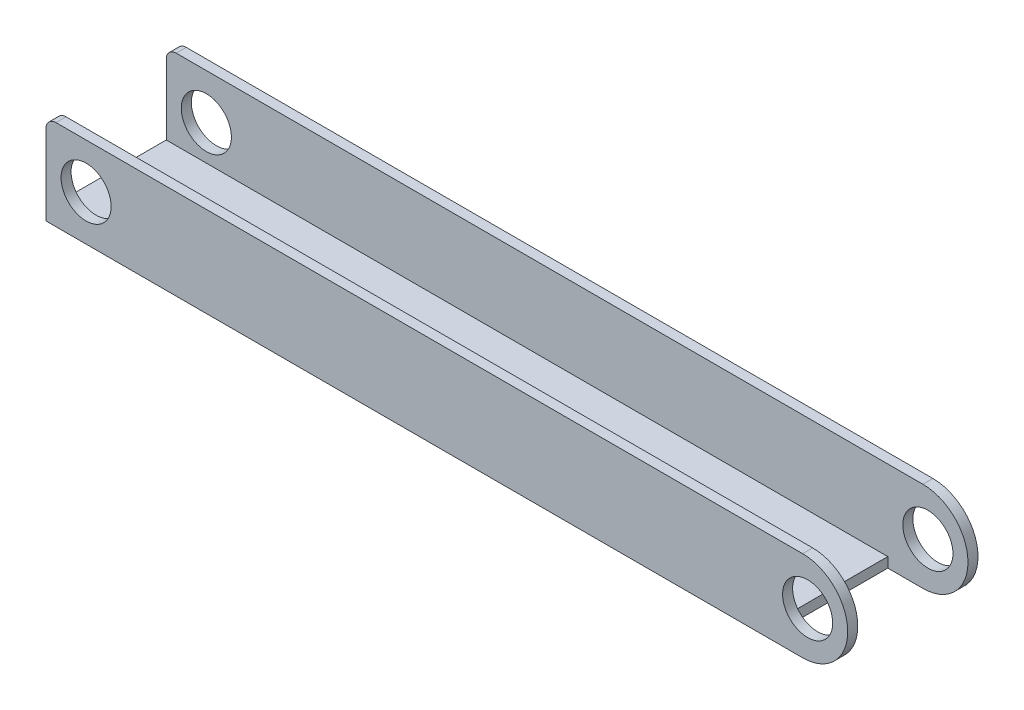
ISO-10303-21;
HEADER;
FILE_DESCRIPTION(('STEP AP214'),'2;1');
FILE_NAME('part.step','',(''),(''),'','','');
FILE_SCHEMA(('AUTOMOTIVE_DESIGN { 1 0 10303 214 1 1 1 1 }'));
ENDSEC;
DATA;
#1=APPLICATION_CONTEXT('core data for automotive mechanical design processes');
#2=APPLICATION_PROTOCOL_DEFINITION('international standard','automotive_design',2000,#1);
#3=PRODUCT_CONTEXT('',#1,'mechanical');
#4=PRODUCT('Part','Part','',(#3));
#5=PRODUCT_RELATED_PRODUCT_CATEGORY('part','',(#4));
#6=PRODUCT_DEFINITION_FORMATION('','',#4);
#7=PRODUCT_DEFINITION_CONTEXT('part definition',#1,'design');
#8=PRODUCT_DEFINITION('design','',#6,#7);
#9=PRODUCT_DEFINITION_SHAPE('','',#8);
#10=(LENGTH_UNIT() NAMED_UNIT(*) SI_UNIT(.MILLI.,.METRE.));
#11=(NAMED_UNIT(*) PLANE_ANGLE_UNIT() SI_UNIT($,.RADIAN.));
#12=(NAMED_UNIT(*) SI_UNIT($,.STERADIAN.) SOLID_ANGLE_UNIT());
#13=UNCERTAINTY_MEASURE_WITH_UNIT(LENGTH_MEASURE(1.E-05),#10,'distance_accuracy_value','');
#14=(GEOMETRIC_REPRESENTATION_CONTEXT(3) GLOBAL_UNCERTAINTY_ASSIGNED_CONTEXT((#13)) GLOBAL_UNIT_ASSIGNED_CONTEXT((#10,
#11,#12)) REPRESENTATION_CONTEXT('',''));
#15=CARTESIAN_POINT('',(0.,0.,0.));
#16=DIRECTION('',(0.,0.,1.));
#17=DIRECTION('',(1.,0.,0.));
#18=AXIS2_PLACEMENT_3D('',#15,#16,#17);
#19=CARTESIAN_POINT('',(177.5,17.5,32.5));
#20=DIRECTION('',(0.,0.,-1.));
#21=DIRECTION('',(-1.,0.,0.));
#22=AXIS2_PLACEMENT_3D('',#19,#20,#21);
#23=CYLINDRICAL_SURFACE('',#22,22.5);
#24=DIRECTION('',(0.,0.,1.));
#25=VECTOR('',#24,1.);
#26=CARTESIAN_POINT('',(177.5,40.,32.5));
#27=LINE('',#26,#25);
#28=CARTESIAN_POINT('',(177.5,40.,32.5));
#29=VERTEX_POINT('',#28);
#30=CARTESIAN_POINT('',(177.5,40.,27.5));
#31=VERTEX_POINT('',#30);
#32=EDGE_CURVE('E239',#29,#31,#27,.F.);
#33=ORIENTED_EDGE('',*,*,#32,.F.);
#34=CARTESIAN_POINT('',(177.5,17.5,32.5));
#35=DIRECTION('',(0.,0.,-1.));
#36=DIRECTION('',(0.,1.,0.));
#37=AXIS2_PLACEMENT_3D('',#34,#35,#36);
#38=CIRCLE('',#37,22.5);
#39=CARTESIAN_POINT('',(177.5,-5.,32.5));
#40=VERTEX_POINT('',#39);
#41=EDGE_CURVE('E42',#40,#29,#38,.F.);
#42=ORIENTED_EDGE('',*,*,#41,.F.);
#43=DIRECTION('',(0.,0.,-1.));
#44=VECTOR('',#43,1.);
#45=CARTESIAN_POINT('',(177.5,-5.,27.5));
#46=LINE('',#45,#44);
#47=CARTESIAN_POINT('',(177.5,-5.,27.5));
#48=VERTEX_POINT('',#47);
#49=EDGE_CURVE('E242',#48,#40,#46,.F.);
#50=ORIENTED_EDGE('',*,*,#49,.F.);
#51=CARTESIAN_POINT('',(177.5,17.5,27.5));
#52=DIRECTION('',(0.,0.,-1.));
#53=DIRECTION('',(0.,1.,0.));
#54=AXIS2_PLACEMENT_3D('',#51,#52,#53);
#55=CIRCLE('',#54,22.5);
#56=EDGE_CURVE('E11',#31,#48,#55,.T.);
#57=ORIENTED_EDGE('',*,*,#56,.F.);
#58=EDGE_LOOP('',(#33,#42,#50,#57));
#59=FACE_BOUND('',#58,.T.);
#60=ADVANCED_FACE('F34',(#59),#23,.T.);
#61=CARTESIAN_POINT('',(177.5,17.5,-27.5));
#62=DIRECTION('',(0.,0.,-1.));
#63=DIRECTION('',(-1.,0.,0.));
#64=AXIS2_PLACEMENT_3D('',#61,#62,#63);
#65=CYLINDRICAL_SURFACE('',#64,22.5);
#66=DIRECTION('',(0.,0.,1.));
#67=VECTOR('',#66,1.);
#68=CARTESIAN_POINT('',(177.5,40.,-27.5));
#69=LINE('',#68,#67);
#70=CARTESIAN_POINT('',(177.5,40.,-27.5));
#71=VERTEX_POINT('',#70);
#72=CARTESIAN_POINT('',(177.5,40.,-32.5));
#73=VERTEX_POINT('',#72);
#74=EDGE_CURVE('E231',#71,#73,#69,.F.);
#75=ORIENTED_EDGE('',*,*,#74,.F.);
#76=CARTESIAN_POINT('',(177.5,17.5,-27.5));
#77=DIRECTION('',(0.,0.,1.));
#78=DIRECTION('',(0.,-1.,0.));
#79=AXIS2_PLACEMENT_3D('',#76,#77,#78);
#80=CIRCLE('',#79,22.5);
#81=CARTESIAN_POINT('',(177.5,-5.,-27.5));
#82=VERTEX_POINT('',#81);
#83=EDGE_CURVE('E235',#82,#71,#80,.T.);
#84=ORIENTED_EDGE('',*,*,#83,.F.);
#85=DIRECTION('',(0.,0.,-1.));
#86=VECTOR('',#85,1.);
#87=CARTESIAN_POINT('',(177.5,-5.,27.5));
#88=LINE('',#87,#86);
#89=CARTESIAN_POINT('',(177.5,-5.,-32.5));
#90=VERTEX_POINT('',#89);
#91=EDGE_CURVE('E130',#90,#82,#88,.F.);
#92=ORIENTED_EDGE('',*,*,#91,.F.);
#93=CARTESIAN_POINT('',(177.5,17.5,-32.5));
#94=DIRECTION('',(0.,0.,1.));
#95=DIRECTION('',(0.,-1.,0.));
#96=AXIS2_PLACEMENT_3D('',#93,#94,#95);
#97=CIRCLE('',#96,22.5);
#98=EDGE_CURVE('E237',#73,#90,#97,.F.);
#99=ORIENTED_EDGE('',*,*,#98,.F.);
#100=EDGE_LOOP('',(#75,#84,#92,#99));
#101=FACE_BOUND('',#100,.T.);
#102=ADVANCED_FACE('F276',(#101),#65,.T.);
#103=CARTESIAN_POINT('',(200.,0.,27.5));
#104=DIRECTION('',(0.,1.,0.));
#105=DIRECTION('',(0.,0.,1.));
#106=AXIS2_PLACEMENT_3D('',#103,#104,#105);
#107=PLANE('',#106);
#108=DIRECTION('',(-1.,0.,0.));
#109=VECTOR('',#108,1.);
#110=CARTESIAN_POINT('',(200.,0.,27.5));
#111=LINE('',#110,#109);
#112=CARTESIAN_POINT('',(160.,0.,27.5));
#113=VERTEX_POINT('',#112);
#114=CARTESIAN_POINT('',(-200.,0.,27.5));
#115=VERTEX_POINT('',#114);
#116=EDGE_CURVE('E202',#113,#115,#111,.T.);
#117=ORIENTED_EDGE('',*,*,#116,.F.);
#118=DIRECTION('',(0.,0.,-1.));
#119=VECTOR('',#118,1.);
#120=CARTESIAN_POINT('',(160.,0.,27.5));
#121=LINE('',#120,#119);
#122=CARTESIAN_POINT('',(160.,0.,-27.5));
#123=VERTEX_POINT('',#122);
#124=EDGE_CURVE('E141',#113,#123,#121,.T.);
#125=ORIENTED_EDGE('',*,*,#124,.T.);
#126=DIRECTION('',(-1.,0.,0.));
#127=VECTOR('',#126,1.);
#128=CARTESIAN_POINT('',(200.,0.,-27.5));
#129=LINE('',#128,#127);
#130=CARTESIAN_POINT('',(-200.,0.,-27.5));
#131=VERTEX_POINT('',#130);
#132=EDGE_CURVE('E138',#123,#131,#129,.T.);
#133=ORIENTED_EDGE('',*,*,#132,.T.);
#134=DIRECTION('',(0.,0.,-1.));
#135=VECTOR('',#134,1.);
#136=CARTESIAN_POINT('',(-200.,0.,27.5));
#137=LINE('',#136,#135);
#138=EDGE_CURVE('E182',#115,#131,#137,.T.);
#139=ORIENTED_EDGE('',*,*,#138,.F.);
#140=EDGE_LOOP('',(#117,#125,#133,#139));
#141=FACE_BOUND('',#140,.T.);
#142=ADVANCED_FACE('F265',(#141),#107,.T.);
#143=CARTESIAN_POINT('',(200.,-5.,27.5));
#144=DIRECTION('',(0.,1.,0.));
#145=DIRECTION('',(0.,0.,1.));
#146=AXIS2_PLACEMENT_3D('',#143,#144,#145);
#147=PLANE('',#146);
#148=DIRECTION('',(1.,0.,0.));
#149=VECTOR('',#148,1.);
#150=CARTESIAN_POINT('',(200.,-5.,27.5));
#151=LINE('',#150,#149);
#152=CARTESIAN_POINT('',(160.,-5.,27.5));
#153=VERTEX_POINT('',#152);
#154=EDGE_CURVE('E146',#153,#48,#151,.T.);
#155=ORIENTED_EDGE('',*,*,#154,.T.);
#156=ORIENTED_EDGE('',*,*,#49,.T.);
#157=DIRECTION('',(-1.,0.,0.));
#158=VECTOR('',#157,1.);
#159=CARTESIAN_POINT('',(200.,-5.,32.5));
#160=LINE('',#159,#158);
#161=CARTESIAN_POINT('',(-200.,-5.,32.5));
#162=VERTEX_POINT('',#161);
#163=EDGE_CURVE('E196',#40,#162,#160,.T.);
#164=ORIENTED_EDGE('',*,*,#163,.T.);
#165=DIRECTION('',(0.,0.,-1.));
#166=VECTOR('',#165,1.);
#167=CARTESIAN_POINT('',(-200.,-5.,27.5));
#168=LINE('',#167,#166);
#169=CARTESIAN_POINT('',(-200.,-5.,-32.5));
#170=VERTEX_POINT('',#169);
#171=EDGE_CURVE('E191',#162,#170,#168,.T.);
#172=ORIENTED_EDGE('',*,*,#171,.T.);
#173=DIRECTION('',(-1.,0.,0.));
#174=VECTOR('',#173,1.);
#175=CARTESIAN_POINT('',(200.,-5.,-32.5));
#176=LINE('',#175,#174);
#177=EDGE_CURVE('E194',#90,#170,#176,.T.);
#178=ORIENTED_EDGE('',*,*,#177,.F.);
#179=ORIENTED_EDGE('',*,*,#91,.T.);
#180=DIRECTION('',(-1.,0.,0.));
#181=VECTOR('',#180,1.);
#182=CARTESIAN_POINT('',(160.,-5.,-27.5));
#183=LINE('',#182,#181);
#184=CARTESIAN_POINT('',(160.,-5.,-27.5));
#185=VERTEX_POINT('',#184);
#186=EDGE_CURVE('E122',#82,#185,#183,.T.);
#187=ORIENTED_EDGE('',*,*,#186,.T.);
#188=DIRECTION('',(0.,0.,1.));
#189=VECTOR('',#188,1.);
#190=CARTESIAN_POINT('',(160.,-5.,27.5));
#191=LINE('',#190,#189);
#192=EDGE_CURVE('E127',#185,#153,#191,.T.);
#193=ORIENTED_EDGE('',*,*,#192,.T.);
#194=EDGE_LOOP('',(#155,#156,#164,#172,#178,#179,#187,#193));
#195=FACE_BOUND('',#194,.T.);
#196=ADVANCED_FACE('F125',(#195),#147,.F.);
#197=CARTESIAN_POINT('',(200.,0.,-32.5));
#198=DIRECTION('',(0.,0.,1.));
#199=DIRECTION('',(0.,-1.,0.));
#200=AXIS2_PLACEMENT_3D('',#197,#198,#199);
#201=PLANE('',#200);
#202=CARTESIAN_POINT('',(180.,17.5,-32.5));
#203=DIRECTION('',(0.,0.,1.));
#204=DIRECTION('',(1.,0.,0.));
#205=AXIS2_PLACEMENT_3D('',#202,#203,#204);
#206=CIRCLE('',#205,12.5);
#207=CARTESIAN_POINT('',(192.5,17.5,-32.5));
#208=VERTEX_POINT('',#207);
#209=EDGE_CURVE('E155',#208,#208,#206,.T.);
#210=ORIENTED_EDGE('',*,*,#209,.T.);
#211=EDGE_LOOP('',(#210));
#212=FACE_BOUND('',#211,.T.);
#213=CARTESIAN_POINT('',(-180.,17.5,-32.5));
#214=DIRECTION('',(0.,0.,1.));
#215=DIRECTION('',(1.,0.,0.));
#216=AXIS2_PLACEMENT_3D('',#213,#214,#215);
#217=CIRCLE('',#216,12.5);
#218=CARTESIAN_POINT('',(-167.5,17.5,-32.5));
#219=VERTEX_POINT('',#218);
#220=EDGE_CURVE('E167',#219,#219,#217,.T.);
#221=ORIENTED_EDGE('',*,*,#220,.T.);
#222=EDGE_LOOP('',(#221));
#223=FACE_BOUND('',#222,.T.);
#224=DIRECTION('',(-1.,0.,0.));
#225=VECTOR('',#224,1.);
#226=CARTESIAN_POINT('',(200.,40.,-32.5));
#227=LINE('',#226,#225);
#228=CARTESIAN_POINT('',(-195.,40.,-32.5));
#229=VERTEX_POINT('',#228);
#230=EDGE_CURVE('E207',#73,#229,#227,.T.);
#231=ORIENTED_EDGE('',*,*,#230,.F.);
#232=ORIENTED_EDGE('',*,*,#98,.T.);
#233=ORIENTED_EDGE('',*,*,#177,.T.);
#234=DIRECTION('',(0.,1.,0.));
#235=VECTOR('',#234,1.);
#236=CARTESIAN_POINT('',(-200.,0.,-32.5));
#237=LINE('',#236,#235);
#238=CARTESIAN_POINT('',(-200.,35.,-32.5));
#239=VERTEX_POINT('',#238);
#240=EDGE_CURVE('E176',#170,#239,#237,.T.);
#241=ORIENTED_EDGE('',*,*,#240,.T.);
#242=CARTESIAN_POINT('',(-195.,35.,-32.5));
#243=DIRECTION('',(0.,0.,1.));
#244=DIRECTION('',(0.,-1.,0.));
#245=AXIS2_PLACEMENT_3D('',#242,#243,#244);
#246=CIRCLE('',#245,5.);
#247=EDGE_CURVE('E215',#239,#229,#246,.F.);
#248=ORIENTED_EDGE('',*,*,#247,.T.);
#249=EDGE_LOOP('',(#231,#232,#233,#241,#248));
#250=FACE_BOUND('',#249,.T.);
#251=ADVANCED_FACE('F273',(#212,#223,#250),#201,.F.);
#252=CARTESIAN_POINT('',(200.,40.,-27.5));
#253=DIRECTION('',(0.,1.,0.));
#254=DIRECTION('',(0.,0.,1.));
#255=AXIS2_PLACEMENT_3D('',#252,#253,#254);
#256=PLANE('',#255);
#257=DIRECTION('',(-1.,0.,0.));
#258=VECTOR('',#257,1.);
#259=CARTESIAN_POINT('',(200.,40.,-27.5));
#260=LINE('',#259,#258);
#261=CARTESIAN_POINT('',(-195.,40.,-27.5));
#262=VERTEX_POINT('',#261);
#263=EDGE_CURVE('E205',#71,#262,#260,.T.);
#264=ORIENTED_EDGE('',*,*,#263,.F.);
#265=ORIENTED_EDGE('',*,*,#74,.T.);
#266=ORIENTED_EDGE('',*,*,#230,.T.);
#267=DIRECTION('',(0.,0.,-1.));
#268=VECTOR('',#267,1.);
#269=CARTESIAN_POINT('',(-195.,40.,-27.5));
#270=LINE('',#269,#268);
#271=EDGE_CURVE('E218',#229,#262,#270,.F.);
#272=ORIENTED_EDGE('',*,*,#271,.T.);
#273=EDGE_LOOP('',(#264,#265,#266,#272));
#274=FACE_BOUND('',#273,.T.);
#275=ADVANCED_FACE('F279',(#274),#256,.T.);
#276=CARTESIAN_POINT('',(200.,0.,-27.5));
#277=DIRECTION('',(0.,0.,1.));
#278=DIRECTION('',(0.,-1.,0.));
#279=AXIS2_PLACEMENT_3D('',#276,#277,#278);
#280=PLANE('',#279);
#281=ORIENTED_EDGE('',*,*,#186,.F.);
#282=ORIENTED_EDGE('',*,*,#83,.T.);
#283=ORIENTED_EDGE('',*,*,#263,.T.);
#284=CARTESIAN_POINT('',(-195.,35.,-27.5));
#285=DIRECTION('',(0.,0.,1.));
#286=DIRECTION('',(0.,-1.,0.));
#287=AXIS2_PLACEMENT_3D('',#284,#285,#286);
#288=CIRCLE('',#287,5.);
#289=CARTESIAN_POINT('',(-200.,35.,-27.5));
#290=VERTEX_POINT('',#289);
#291=EDGE_CURVE('E221',#262,#290,#288,.T.);
#292=ORIENTED_EDGE('',*,*,#291,.T.);
#293=DIRECTION('',(0.,1.,0.));
#294=VECTOR('',#293,1.);
#295=CARTESIAN_POINT('',(-200.,0.,-27.5));
#296=LINE('',#295,#294);
#297=EDGE_CURVE('E179',#131,#290,#296,.T.);
#298=ORIENTED_EDGE('',*,*,#297,.F.);
#299=ORIENTED_EDGE('',*,*,#132,.F.);
#300=DIRECTION('',(0.,-1.,0.));
#301=VECTOR('',#300,1.);
#302=CARTESIAN_POINT('',(160.,40.,-27.5));
#303=LINE('',#302,#301);
#304=EDGE_CURVE('E134',#123,#185,#303,.T.);
#305=ORIENTED_EDGE('',*,*,#304,.T.);
#306=EDGE_LOOP('',(#281,#282,#283,#292,#298,#299,#305));
#307=FACE_BOUND('',#306,.T.);
#308=CARTESIAN_POINT('',(180.,17.5,-27.5));
#309=DIRECTION('',(0.,0.,1.));
#310=DIRECTION('',(0.,-1.,0.));
#311=AXIS2_PLACEMENT_3D('',#308,#309,#310);
#312=CIRCLE('',#311,12.5);
#313=CARTESIAN_POINT('',(180.,5.,-27.5));
#314=VERTEX_POINT('',#313);
#315=EDGE_CURVE('E161',#314,#314,#312,.T.);
#316=ORIENTED_EDGE('',*,*,#315,.F.);
#317=EDGE_LOOP('',(#316));
#318=FACE_BOUND('',#317,.T.);
#319=CARTESIAN_POINT('',(-180.,17.5,-27.5));
#320=DIRECTION('',(0.,0.,1.));
#321=DIRECTION('',(0.,-1.,0.));
#322=AXIS2_PLACEMENT_3D('',#319,#320,#321);
#323=CIRCLE('',#322,12.5);
#324=CARTESIAN_POINT('',(-180.,5.,-27.5));
#325=VERTEX_POINT('',#324);
#326=EDGE_CURVE('E173',#325,#325,#323,.T.);
#327=ORIENTED_EDGE('',*,*,#326,.F.);
#328=EDGE_LOOP('',(#327));
#329=FACE_BOUND('',#328,.T.);
#330=ADVANCED_FACE('F135',(#307,#318,#329),#280,.T.);
#331=CARTESIAN_POINT('',(200.,40.,27.5));
#332=DIRECTION('',(0.,0.,-1.));
#333=DIRECTION('',(0.,1.,0.));
#334=AXIS2_PLACEMENT_3D('',#331,#332,#333);
#335=PLANE('',#334);
#336=DIRECTION('',(-1.,0.,0.));
#337=VECTOR('',#336,1.);
#338=CARTESIAN_POINT('',(200.,40.,27.5));
#339=LINE('',#338,#337);
#340=CARTESIAN_POINT('',(-195.,40.,27.5));
#341=VERTEX_POINT('',#340);
#342=EDGE_CURVE('E200',#31,#341,#339,.T.);
#343=ORIENTED_EDGE('',*,*,#342,.F.);
#344=ORIENTED_EDGE('',*,*,#56,.T.);
#345=ORIENTED_EDGE('',*,*,#154,.F.);
#346=DIRECTION('',(0.,-1.,0.));
#347=VECTOR('',#346,1.);
#348=CARTESIAN_POINT('',(160.,40.,27.5));
#349=LINE('',#348,#347);
#350=EDGE_CURVE('E142',#113,#153,#349,.T.);
#351=ORIENTED_EDGE('',*,*,#350,.F.);
#352=ORIENTED_EDGE('',*,*,#116,.T.);
#353=DIRECTION('',(0.,-1.,0.));
#354=VECTOR('',#353,1.);
#355=CARTESIAN_POINT('',(-200.,40.,27.5));
#356=LINE('',#355,#354);
#357=CARTESIAN_POINT('',(-200.,35.,27.5));
#358=VERTEX_POINT('',#357);
#359=EDGE_CURVE('E185',#358,#115,#356,.T.);
#360=ORIENTED_EDGE('',*,*,#359,.F.);
#361=CARTESIAN_POINT('',(-195.,35.,27.5));
#362=DIRECTION('',(0.,0.,-1.));
#363=DIRECTION('',(0.,1.,0.));
#364=AXIS2_PLACEMENT_3D('',#361,#362,#363);
#365=CIRCLE('',#364,5.);
#366=EDGE_CURVE('E223',#358,#341,#365,.T.);
#367=ORIENTED_EDGE('',*,*,#366,.T.);
#368=EDGE_LOOP('',(#343,#344,#345,#351,#352,#360,#367));
#369=FACE_BOUND('',#368,.T.);
#370=CARTESIAN_POINT('',(180.,17.5,27.5));
#371=DIRECTION('',(0.,0.,-1.));
#372=DIRECTION('',(0.,1.,0.));
#373=AXIS2_PLACEMENT_3D('',#370,#371,#372);
#374=CIRCLE('',#373,12.5);
#375=CARTESIAN_POINT('',(180.,30.,27.5));
#376=VERTEX_POINT('',#375);
#377=EDGE_CURVE('E158',#376,#376,#374,.T.);
#378=ORIENTED_EDGE('',*,*,#377,.F.);
#379=EDGE_LOOP('',(#378));
#380=FACE_BOUND('',#379,.T.);
#381=CARTESIAN_POINT('',(-180.,17.5,27.5));
#382=DIRECTION('',(0.,0.,-1.));
#383=DIRECTION('',(0.,1.,0.));
#384=AXIS2_PLACEMENT_3D('',#381,#382,#383);
#385=CIRCLE('',#384,12.5);
#386=CARTESIAN_POINT('',(-180.,30.,27.5));
#387=VERTEX_POINT('',#386);
#388=EDGE_CURVE('E170',#387,#387,#385,.T.);
#389=ORIENTED_EDGE('',*,*,#388,.F.);
#390=EDGE_LOOP('',(#389));
#391=FACE_BOUND('',#390,.T.);
#392=ADVANCED_FACE('F260',(#369,#380,#391),#335,.T.);
#393=CARTESIAN_POINT('',(200.,40.,32.5));
#394=DIRECTION('',(0.,1.,0.));
#395=DIRECTION('',(0.,0.,1.));
#396=AXIS2_PLACEMENT_3D('',#393,#394,#395);
#397=PLANE('',#396);
#398=DIRECTION('',(-1.,0.,0.));
#399=VECTOR('',#398,1.);
#400=CARTESIAN_POINT('',(200.,40.,32.5));
#401=LINE('',#400,#399);
#402=CARTESIAN_POINT('',(-195.,40.,32.5));
#403=VERTEX_POINT('',#402);
#404=EDGE_CURVE('E198',#29,#403,#401,.T.);
#405=ORIENTED_EDGE('',*,*,#404,.F.);
#406=ORIENTED_EDGE('',*,*,#32,.T.);
#407=ORIENTED_EDGE('',*,*,#342,.T.);
#408=DIRECTION('',(0.,0.,-1.));
#409=VECTOR('',#408,1.);
#410=CARTESIAN_POINT('',(-195.,40.,32.5));
#411=LINE('',#410,#409);
#412=EDGE_CURVE('E226',#341,#403,#411,.F.);
#413=ORIENTED_EDGE('',*,*,#412,.T.);
#414=EDGE_LOOP('',(#405,#406,#407,#413));
#415=FACE_BOUND('',#414,.T.);
#416=ADVANCED_FACE('F248',(#415),#397,.T.);
#417=CARTESIAN_POINT('',(200.,40.,32.5));
#418=DIRECTION('',(0.,0.,-1.));
#419=DIRECTION('',(0.,1.,0.));
#420=AXIS2_PLACEMENT_3D('',#417,#418,#419);
#421=PLANE('',#420);
#422=CARTESIAN_POINT('',(180.,17.5,32.5));
#423=DIRECTION('',(0.,0.,1.));
#424=DIRECTION('',(1.,0.,0.));
#425=AXIS2_PLACEMENT_3D('',#422,#423,#424);
#426=CIRCLE('',#425,12.5);
#427=CARTESIAN_POINT('',(192.5,17.5,32.5));
#428=VERTEX_POINT('',#427);
#429=EDGE_CURVE('E152',#428,#428,#426,.T.);
#430=ORIENTED_EDGE('',*,*,#429,.F.);
#431=EDGE_LOOP('',(#430));
#432=FACE_BOUND('',#431,.T.);
#433=CARTESIAN_POINT('',(-180.,17.5,32.5));
#434=DIRECTION('',(0.,0.,1.));
#435=DIRECTION('',(1.,0.,0.));
#436=AXIS2_PLACEMENT_3D('',#433,#434,#435);
#437=CIRCLE('',#436,12.5);
#438=CARTESIAN_POINT('',(-167.5,17.5,32.5));
#439=VERTEX_POINT('',#438);
#440=EDGE_CURVE('E164',#439,#439,#437,.T.);
#441=ORIENTED_EDGE('',*,*,#440,.F.);
#442=EDGE_LOOP('',(#441));
#443=FACE_BOUND('',#442,.T.);
#444=ORIENTED_EDGE('',*,*,#163,.F.);
#445=ORIENTED_EDGE('',*,*,#41,.T.);
#446=ORIENTED_EDGE('',*,*,#404,.T.);
#447=CARTESIAN_POINT('',(-195.,35.,32.5));
#448=DIRECTION('',(0.,0.,-1.));
#449=DIRECTION('',(0.,1.,0.));
#450=AXIS2_PLACEMENT_3D('',#447,#448,#449);
#451=CIRCLE('',#450,5.);
#452=CARTESIAN_POINT('',(-200.,35.,32.5));
#453=VERTEX_POINT('',#452);
#454=EDGE_CURVE('E229',#403,#453,#451,.F.);
#455=ORIENTED_EDGE('',*,*,#454,.T.);
#456=DIRECTION('',(0.,-1.,0.));
#457=VECTOR('',#456,1.);
#458=CARTESIAN_POINT('',(-200.,40.,32.5));
#459=LINE('',#458,#457);
#460=EDGE_CURVE('E188',#453,#162,#459,.T.);
#461=ORIENTED_EDGE('',*,*,#460,.T.);
#462=EDGE_LOOP('',(#444,#445,#446,#455,#461));
#463=FACE_BOUND('',#462,.T.);
#464=ADVANCED_FACE('F245',(#432,#443,#463),#421,.F.);
#465=CARTESIAN_POINT('',(-200.,0.,0.));
#466=DIRECTION('',(-1.,0.,0.));
#467=DIRECTION('',(0.,0.,1.));
#468=AXIS2_PLACEMENT_3D('',#465,#466,#467);
#469=PLANE('',#468);
#470=ORIENTED_EDGE('',*,*,#297,.T.);
#471=DIRECTION('',(0.,0.,-1.));
#472=VECTOR('',#471,1.);
#473=CARTESIAN_POINT('',(-200.,35.,0.));
#474=LINE('',#473,#472);
#475=EDGE_CURVE('E212',#290,#239,#474,.T.);
#476=ORIENTED_EDGE('',*,*,#475,.T.);
#477=ORIENTED_EDGE('',*,*,#240,.F.);
#478=ORIENTED_EDGE('',*,*,#171,.F.);
#479=ORIENTED_EDGE('',*,*,#460,.F.);
#480=DIRECTION('',(0.,0.,-1.));
#481=VECTOR('',#480,1.);
#482=CARTESIAN_POINT('',(-200.,35.,0.));
#483=LINE('',#482,#481);
#484=EDGE_CURVE('E209',#453,#358,#483,.T.);
#485=ORIENTED_EDGE('',*,*,#484,.T.);
#486=ORIENTED_EDGE('',*,*,#359,.T.);
#487=ORIENTED_EDGE('',*,*,#138,.T.);
#488=EDGE_LOOP('',(#470,#476,#477,#478,#479,#485,#486,#487));
#489=FACE_BOUND('',#488,.T.);
#490=ADVANCED_FACE('F257',(#489),#469,.T.);
#491=CARTESIAN_POINT('',(-180.,17.5,-32.5));
#492=DIRECTION('',(0.,0.,1.));
#493=DIRECTION('',(1.,0.,0.));
#494=AXIS2_PLACEMENT_3D('',#491,#492,#493);
#495=CYLINDRICAL_SURFACE('',#494,12.5);
#496=ORIENTED_EDGE('',*,*,#388,.T.);
#497=EDGE_LOOP('',(#496));
#498=FACE_BOUND('',#497,.T.);
#499=ORIENTED_EDGE('',*,*,#440,.T.);
#500=EDGE_LOOP('',(#499));
#501=FACE_BOUND('',#500,.T.);
#502=ADVANCED_FACE('F319',(#498,#501),#495,.F.);
#503=ORIENTED_EDGE('',*,*,#326,.T.);
#504=EDGE_LOOP('',(#503));
#505=FACE_BOUND('',#504,.T.);
#506=ORIENTED_EDGE('',*,*,#220,.F.);
#507=EDGE_LOOP('',(#506));
#508=FACE_BOUND('',#507,.T.);
#509=ADVANCED_FACE('F314',(#505,#508),#495,.F.);
#510=CARTESIAN_POINT('',(180.,17.5,-32.5));
#511=DIRECTION('',(0.,0.,1.));
#512=DIRECTION('',(1.,0.,0.));
#513=AXIS2_PLACEMENT_3D('',#510,#511,#512);
#514=CYLINDRICAL_SURFACE('',#513,12.5);
#515=ORIENTED_EDGE('',*,*,#377,.T.);
#516=EDGE_LOOP('',(#515));
#517=FACE_BOUND('',#516,.T.);
#518=ORIENTED_EDGE('',*,*,#429,.T.);
#519=EDGE_LOOP('',(#518));
#520=FACE_BOUND('',#519,.T.);
#521=ADVANCED_FACE('F308',(#517,#520),#514,.F.);
#522=ORIENTED_EDGE('',*,*,#315,.T.);
#523=EDGE_LOOP('',(#522));
#524=FACE_BOUND('',#523,.T.);
#525=ORIENTED_EDGE('',*,*,#209,.F.);
#526=EDGE_LOOP('',(#525));
#527=FACE_BOUND('',#526,.T.);
#528=ADVANCED_FACE('F304',(#524,#527),#514,.F.);
#529=CARTESIAN_POINT('',(-195.,35.,0.));
#530=DIRECTION('',(0.,0.,-1.));
#531=DIRECTION('',(-1.,0.,0.));
#532=AXIS2_PLACEMENT_3D('',#529,#530,#531);
#533=CYLINDRICAL_SURFACE('',#532,5.);
#534=ORIENTED_EDGE('',*,*,#291,.F.);
#535=ORIENTED_EDGE('',*,*,#271,.F.);
#536=ORIENTED_EDGE('',*,*,#247,.F.);
#537=ORIENTED_EDGE('',*,*,#475,.F.);
#538=EDGE_LOOP('',(#534,#535,#536,#537));
#539=FACE_BOUND('',#538,.T.);
#540=ADVANCED_FACE('F269',(#539),#533,.T.);
#541=CARTESIAN_POINT('',(-195.,35.,0.));
#542=DIRECTION('',(0.,0.,-1.));
#543=DIRECTION('',(-1.,0.,0.));
#544=AXIS2_PLACEMENT_3D('',#541,#542,#543);
#545=CYLINDRICAL_SURFACE('',#544,5.);
#546=ORIENTED_EDGE('',*,*,#454,.F.);
#547=ORIENTED_EDGE('',*,*,#412,.F.);
#548=ORIENTED_EDGE('',*,*,#366,.F.);
#549=ORIENTED_EDGE('',*,*,#484,.F.);
#550=EDGE_LOOP('',(#546,#547,#548,#549));
#551=FACE_BOUND('',#550,.T.);
#552=ADVANCED_FACE('F253',(#551),#545,.T.);
#553=CARTESIAN_POINT('',(160.,40.,27.5));
#554=DIRECTION('',(1.,0.,0.));
#555=DIRECTION('',(0.,0.,-1.));
#556=AXIS2_PLACEMENT_3D('',#553,#554,#555);
#557=PLANE('',#556);
#558=ORIENTED_EDGE('',*,*,#350,.T.);
#559=ORIENTED_EDGE('',*,*,#192,.F.);
#560=ORIENTED_EDGE('',*,*,#304,.F.);
#561=ORIENTED_EDGE('',*,*,#124,.F.);
#562=EDGE_LOOP('',(#558,#559,#560,#561));
#563=FACE_BOUND('',#562,.T.);
#564=ADVANCED_FACE('F144',(#563),#557,.T.);
#565=CLOSED_SHELL('',(#60,#102,#142,#196,#251,#275,#330,#392,#416,#464,#490,#502,#509,#521,#528,
#540,#552,#564));
#566=MANIFOLD_SOLID_BREP('B2',#565);
#567=ADVANCED_BREP_SHAPE_REPRESENTATION('',(#18,#566),#14);
#568=SHAPE_DEFINITION_REPRESENTATION(#9,#567);
ENDSEC;
END-ISO-10303-21;
